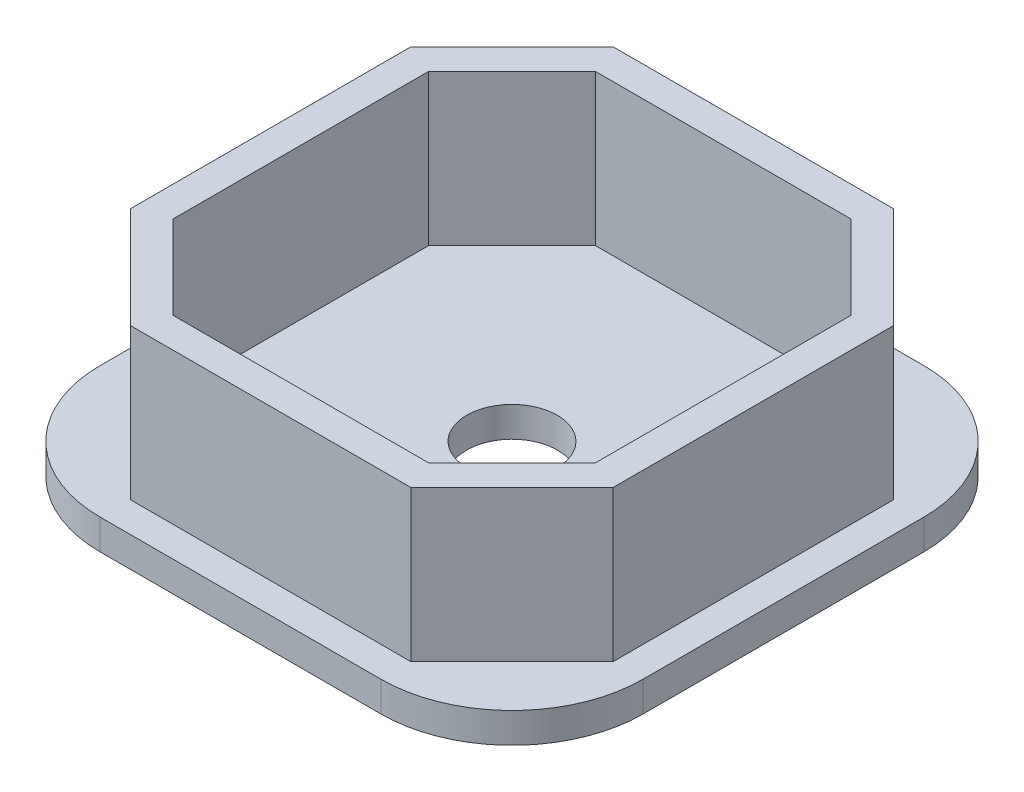
ISO-10303-21;
HEADER;
FILE_DESCRIPTION(('STEP AP214'),'2;1');
FILE_NAME('part.step','',(''),(''),'','','');
FILE_SCHEMA(('AUTOMOTIVE_DESIGN { 1 0 10303 214 1 1 1 1 }'));
ENDSEC;
DATA;
#1=APPLICATION_CONTEXT('core data for automotive mechanical design processes');
#2=APPLICATION_PROTOCOL_DEFINITION('international standard','automotive_design',2000,#1);
#3=PRODUCT_CONTEXT('',#1,'mechanical');
#4=PRODUCT('Part','Part','',(#3));
#5=PRODUCT_RELATED_PRODUCT_CATEGORY('part','',(#4));
#6=PRODUCT_DEFINITION_FORMATION('','',#4);
#7=PRODUCT_DEFINITION_CONTEXT('part definition',#1,'design');
#8=PRODUCT_DEFINITION('design','',#6,#7);
#9=PRODUCT_DEFINITION_SHAPE('','',#8);
#10=(LENGTH_UNIT() NAMED_UNIT(*) SI_UNIT(.MILLI.,.METRE.));
#11=(NAMED_UNIT(*) PLANE_ANGLE_UNIT() SI_UNIT($,.RADIAN.));
#12=(NAMED_UNIT(*) SI_UNIT($,.STERADIAN.) SOLID_ANGLE_UNIT());
#13=UNCERTAINTY_MEASURE_WITH_UNIT(LENGTH_MEASURE(1.E-05),#10,'distance_accuracy_value','');
#14=(GEOMETRIC_REPRESENTATION_CONTEXT(3) GLOBAL_UNCERTAINTY_ASSIGNED_CONTEXT((#13)) GLOBAL_UNIT_ASSIGNED_CONTEXT((#10,
#11,#12)) REPRESENTATION_CONTEXT('',''));
#15=CARTESIAN_POINT('',(0.,0.,0.));
#16=DIRECTION('',(0.,0.,1.));
#17=DIRECTION('',(1.,0.,0.));
#18=AXIS2_PLACEMENT_3D('',#15,#16,#17);
#19=CARTESIAN_POINT('',(-4.65,1.,4.65));
#20=DIRECTION('',(0.,-1.,0.));
#21=DIRECTION('',(0.,0.,-1.));
#22=AXIS2_PLACEMENT_3D('',#19,#20,#21);
#23=PLANE('',#22);
#24=CARTESIAN_POINT('',(-4.65,1.,4.65));
#25=DIRECTION('',(0.,1.,0.));
#26=DIRECTION('',(0.,0.,-1.));
#27=AXIS2_PLACEMENT_3D('',#24,#25,#26);
#28=CIRCLE('',#27,4.35);
#29=CARTESIAN_POINT('',(-9.,1.,4.64999999999997));
#30=VERTEX_POINT('',#29);
#31=CARTESIAN_POINT('',(-4.64999999999997,1.,9.));
#32=VERTEX_POINT('',#31);
#33=EDGE_CURVE('E330',#30,#32,#28,.T.);
#34=ORIENTED_EDGE('',*,*,#33,.T.);
#35=DIRECTION('',(1.,0.,0.));
#36=VECTOR('',#35,1.);
#37=CARTESIAN_POINT('',(-4.64999999999997,1.,9.));
#38=LINE('',#37,#36);
#39=CARTESIAN_POINT('',(4.64999999999997,1.,9.));
#40=VERTEX_POINT('',#39);
#41=EDGE_CURVE('E333',#32,#40,#38,.T.);
#42=ORIENTED_EDGE('',*,*,#41,.T.);
#43=CARTESIAN_POINT('',(4.65,1.,4.65));
#44=DIRECTION('',(0.,1.,0.));
#45=DIRECTION('',(0.,0.,-1.));
#46=AXIS2_PLACEMENT_3D('',#43,#44,#45);
#47=CIRCLE('',#46,4.35);
#48=CARTESIAN_POINT('',(9.,1.,4.64999999999997));
#49=VERTEX_POINT('',#48);
#50=EDGE_CURVE('E336',#40,#49,#47,.T.);
#51=ORIENTED_EDGE('',*,*,#50,.T.);
#52=DIRECTION('',(0.,0.,-1.));
#53=VECTOR('',#52,1.);
#54=CARTESIAN_POINT('',(9.,1.,4.64999999999997));
#55=LINE('',#54,#53);
#56=CARTESIAN_POINT('',(9.,1.,-4.64999999999997));
#57=VERTEX_POINT('',#56);
#58=EDGE_CURVE('E338',#49,#57,#55,.T.);
#59=ORIENTED_EDGE('',*,*,#58,.T.);
#60=CARTESIAN_POINT('',(4.65,1.,-4.65));
#61=DIRECTION('',(0.,1.,0.));
#62=DIRECTION('',(0.,0.,-1.));
#63=AXIS2_PLACEMENT_3D('',#60,#61,#62);
#64=CIRCLE('',#63,4.35);
#65=CARTESIAN_POINT('',(4.64999999999997,1.,-9.));
#66=VERTEX_POINT('',#65);
#67=EDGE_CURVE('E340',#57,#66,#64,.T.);
#68=ORIENTED_EDGE('',*,*,#67,.T.);
#69=DIRECTION('',(-1.,0.,0.));
#70=VECTOR('',#69,1.);
#71=CARTESIAN_POINT('',(-4.64999999999997,1.,-9.));
#72=LINE('',#71,#70);
#73=CARTESIAN_POINT('',(-4.64999999999997,1.,-9.));
#74=VERTEX_POINT('',#73);
#75=EDGE_CURVE('E342',#66,#74,#72,.T.);
#76=ORIENTED_EDGE('',*,*,#75,.T.);
#77=CARTESIAN_POINT('',(-4.65,1.,-4.65));
#78=DIRECTION('',(0.,1.,0.));
#79=DIRECTION('',(0.,0.,-1.));
#80=AXIS2_PLACEMENT_3D('',#77,#78,#79);
#81=CIRCLE('',#80,4.35);
#82=CARTESIAN_POINT('',(-9.,1.,-4.64999999999997));
#83=VERTEX_POINT('',#82);
#84=EDGE_CURVE('E344',#74,#83,#81,.T.);
#85=ORIENTED_EDGE('',*,*,#84,.T.);
#86=DIRECTION('',(0.,0.,1.));
#87=VECTOR('',#86,1.);
#88=CARTESIAN_POINT('',(-9.,1.,4.64999999999997));
#89=LINE('',#88,#87);
#90=EDGE_CURVE('E346',#83,#30,#89,.T.);
#91=ORIENTED_EDGE('',*,*,#90,.T.);
#92=EDGE_LOOP('',(#34,#42,#51,#59,#68,#76,#85,#91));
#93=FACE_BOUND('',#92,.T.);
#94=DIRECTION('',(0.,0.,1.));
#95=VECTOR('',#94,1.);
#96=CARTESIAN_POINT('',(-8.,1.,4.64999999999998));
#97=LINE('',#96,#95);
#98=CARTESIAN_POINT('',(-8.,1.,-4.64999999999998));
#99=VERTEX_POINT('',#98);
#100=CARTESIAN_POINT('',(-8.,1.,4.64999999999998));
#101=VERTEX_POINT('',#100);
#102=EDGE_CURVE('E211',#99,#101,#97,.T.);
#103=ORIENTED_EDGE('',*,*,#102,.F.);
#104=DIRECTION('',(-0.707106781186547,0.,0.707106781186547));
#105=VECTOR('',#104,1.);
#106=CARTESIAN_POINT('',(-8.,1.,-4.64999999999998));
#107=LINE('',#106,#105);
#108=CARTESIAN_POINT('',(-4.64999999999998,1.,-8.));
#109=VERTEX_POINT('',#108);
#110=EDGE_CURVE('E268',#109,#99,#107,.T.);
#111=ORIENTED_EDGE('',*,*,#110,.F.);
#112=DIRECTION('',(-1.,0.,0.));
#113=VECTOR('',#112,1.);
#114=CARTESIAN_POINT('',(-4.64999999999998,1.,-8.));
#115=LINE('',#114,#113);
#116=CARTESIAN_POINT('',(4.64999999999998,1.,-8.));
#117=VERTEX_POINT('',#116);
#118=EDGE_CURVE('E296',#117,#109,#115,.T.);
#119=ORIENTED_EDGE('',*,*,#118,.F.);
#120=DIRECTION('',(-0.707106781186547,0.,-0.707106781186547));
#121=VECTOR('',#120,1.);
#122=CARTESIAN_POINT('',(4.64999999999998,1.,-8.));
#123=LINE('',#122,#121);
#124=CARTESIAN_POINT('',(8.,1.,-4.64999999999998));
#125=VERTEX_POINT('',#124);
#126=EDGE_CURVE('E293',#125,#117,#123,.T.);
#127=ORIENTED_EDGE('',*,*,#126,.F.);
#128=DIRECTION('',(0.,0.,-1.));
#129=VECTOR('',#128,1.);
#130=CARTESIAN_POINT('',(8.,1.,4.64999999999998));
#131=LINE('',#130,#129);
#132=CARTESIAN_POINT('',(8.,1.,4.64999999999998));
#133=VERTEX_POINT('',#132);
#134=EDGE_CURVE('E290',#133,#125,#131,.T.);
#135=ORIENTED_EDGE('',*,*,#134,.F.);
#136=DIRECTION('',(0.707106781186547,0.,-0.707106781186547));
#137=VECTOR('',#136,1.);
#138=CARTESIAN_POINT('',(4.64999999999998,1.,8.));
#139=LINE('',#138,#137);
#140=CARTESIAN_POINT('',(4.64999999999998,1.,8.));
#141=VERTEX_POINT('',#140);
#142=EDGE_CURVE('E287',#141,#133,#139,.T.);
#143=ORIENTED_EDGE('',*,*,#142,.F.);
#144=DIRECTION('',(1.,0.,0.));
#145=VECTOR('',#144,1.);
#146=CARTESIAN_POINT('',(-4.64999999999998,1.,8.));
#147=LINE('',#146,#145);
#148=CARTESIAN_POINT('',(-4.64999999999998,1.,8.));
#149=VERTEX_POINT('',#148);
#150=EDGE_CURVE('E53',#149,#141,#147,.T.);
#151=ORIENTED_EDGE('',*,*,#150,.F.);
#152=DIRECTION('',(0.707106781186547,0.,0.707106781186547));
#153=VECTOR('',#152,1.);
#154=CARTESIAN_POINT('',(-4.64999999999998,1.,8.));
#155=LINE('',#154,#153);
#156=EDGE_CURVE('E48',#101,#149,#155,.T.);
#157=ORIENTED_EDGE('',*,*,#156,.F.);
#158=EDGE_LOOP('',(#103,#111,#119,#127,#135,#143,#151,#157));
#159=FACE_BOUND('',#158,.T.);
#160=ADVANCED_FACE('F33',(#93,#159),#23,.F.);
#161=DIRECTION('',(-0.707106781186548,0.,0.707106781186548));
#162=VECTOR('',#161,1.);
#163=CARTESIAN_POINT('',(-7.,1.,-4.23578643762688));
#164=LINE('',#163,#162);
#165=CARTESIAN_POINT('',(-4.23578643762688,1.,-7.));
#166=VERTEX_POINT('',#165);
#167=CARTESIAN_POINT('',(-7.,1.,-4.23578643762688));
#168=VERTEX_POINT('',#167);
#169=EDGE_CURVE('E204',#166,#168,#164,.T.);
#170=ORIENTED_EDGE('',*,*,#169,.T.);
#171=DIRECTION('',(0.,0.,1.));
#172=VECTOR('',#171,1.);
#173=CARTESIAN_POINT('',(-7.,1.,4.23578643762688));
#174=LINE('',#173,#172);
#175=CARTESIAN_POINT('',(-7.,1.,4.23578643762688));
#176=VERTEX_POINT('',#175);
#177=EDGE_CURVE('E232',#168,#176,#174,.T.);
#178=ORIENTED_EDGE('',*,*,#177,.T.);
#179=DIRECTION('',(0.707106781186548,0.,0.707106781186548));
#180=VECTOR('',#179,1.);
#181=CARTESIAN_POINT('',(-4.23578643762688,1.,7.));
#182=LINE('',#181,#180);
#183=CARTESIAN_POINT('',(-4.23578643762688,1.,7.));
#184=VERTEX_POINT('',#183);
#185=EDGE_CURVE('E210',#176,#184,#182,.T.);
#186=ORIENTED_EDGE('',*,*,#185,.T.);
#187=DIRECTION('',(1.,0.,0.));
#188=VECTOR('',#187,1.);
#189=CARTESIAN_POINT('',(-4.23578643762688,1.,7.));
#190=LINE('',#189,#188);
#191=CARTESIAN_POINT('',(4.23578643762688,1.,7.));
#192=VERTEX_POINT('',#191);
#193=EDGE_CURVE('E235',#184,#192,#190,.T.);
#194=ORIENTED_EDGE('',*,*,#193,.T.);
#195=DIRECTION('',(0.707106781186548,0.,-0.707106781186547));
#196=VECTOR('',#195,1.);
#197=CARTESIAN_POINT('',(4.23578643762688,1.,7.));
#198=LINE('',#197,#196);
#199=CARTESIAN_POINT('',(7.,1.,4.23578643762688));
#200=VERTEX_POINT('',#199);
#201=EDGE_CURVE('E238',#192,#200,#198,.T.);
#202=ORIENTED_EDGE('',*,*,#201,.T.);
#203=DIRECTION('',(0.,0.,-1.));
#204=VECTOR('',#203,1.);
#205=CARTESIAN_POINT('',(7.,1.,4.23578643762688));
#206=LINE('',#205,#204);
#207=CARTESIAN_POINT('',(7.,1.,-4.23578643762688));
#208=VERTEX_POINT('',#207);
#209=EDGE_CURVE('E241',#200,#208,#206,.T.);
#210=ORIENTED_EDGE('',*,*,#209,.T.);
#211=DIRECTION('',(-0.707106781186547,0.,-0.707106781186548));
#212=VECTOR('',#211,1.);
#213=CARTESIAN_POINT('',(4.23578643762688,1.,-7.));
#214=LINE('',#213,#212);
#215=CARTESIAN_POINT('',(4.23578643762688,1.,-7.));
#216=VERTEX_POINT('',#215);
#217=EDGE_CURVE('E244',#208,#216,#214,.T.);
#218=ORIENTED_EDGE('',*,*,#217,.T.);
#219=DIRECTION('',(-1.,0.,0.));
#220=VECTOR('',#219,1.);
#221=CARTESIAN_POINT('',(-4.23578643762688,1.,-7.));
#222=LINE('',#221,#220);
#223=EDGE_CURVE('E247',#216,#166,#222,.T.);
#224=ORIENTED_EDGE('',*,*,#223,.T.);
#225=EDGE_LOOP('',(#170,#178,#186,#194,#202,#210,#218,#224));
#226=FACE_BOUND('',#225,.T.);
#227=CARTESIAN_POINT('',(0.,1.,0.));
#228=DIRECTION('',(0.,1.,0.));
#229=DIRECTION('',(0.,0.,1.));
#230=AXIS2_PLACEMENT_3D('',#227,#228,#229);
#231=CIRCLE('',#230,1.5);
#232=CARTESIAN_POINT('',(0.,1.,1.5));
#233=VERTEX_POINT('',#232);
#234=EDGE_CURVE('E324',#233,#233,#231,.T.);
#235=ORIENTED_EDGE('',*,*,#234,.F.);
#236=EDGE_LOOP('',(#235));
#237=FACE_BOUND('',#236,.T.);
#238=ADVANCED_FACE('F431',(#226,#237),#23,.F.);
#239=CARTESIAN_POINT('',(-4.65,0.,4.65));
#240=DIRECTION('',(0.,-1.,0.));
#241=DIRECTION('',(0.,0.,-1.));
#242=AXIS2_PLACEMENT_3D('',#239,#240,#241);
#243=PLANE('',#242);
#244=CARTESIAN_POINT('',(-4.65,0.,4.65));
#245=DIRECTION('',(0.,1.,0.));
#246=DIRECTION('',(0.,0.,-1.));
#247=AXIS2_PLACEMENT_3D('',#244,#245,#246);
#248=CIRCLE('',#247,4.35);
#249=CARTESIAN_POINT('',(-9.,0.,4.64999999999997));
#250=VERTEX_POINT('',#249);
#251=CARTESIAN_POINT('',(-4.64999999999997,0.,9.));
#252=VERTEX_POINT('',#251);
#253=EDGE_CURVE('E327',#250,#252,#248,.T.);
#254=ORIENTED_EDGE('',*,*,#253,.F.);
#255=DIRECTION('',(0.,0.,1.));
#256=VECTOR('',#255,1.);
#257=CARTESIAN_POINT('',(-9.,0.,4.64999999999997));
#258=LINE('',#257,#256);
#259=CARTESIAN_POINT('',(-9.,0.,-4.64999999999997));
#260=VERTEX_POINT('',#259);
#261=EDGE_CURVE('E334',#260,#250,#258,.T.);
#262=ORIENTED_EDGE('',*,*,#261,.F.);
#263=CARTESIAN_POINT('',(-4.65,0.,-4.65));
#264=DIRECTION('',(0.,1.,0.));
#265=DIRECTION('',(0.,0.,-1.));
#266=AXIS2_PLACEMENT_3D('',#263,#264,#265);
#267=CIRCLE('',#266,4.35);
#268=CARTESIAN_POINT('',(-4.64999999999997,0.,-9.));
#269=VERTEX_POINT('',#268);
#270=EDGE_CURVE('E361',#269,#260,#267,.T.);
#271=ORIENTED_EDGE('',*,*,#270,.F.);
#272=DIRECTION('',(-1.,0.,0.));
#273=VECTOR('',#272,1.);
#274=CARTESIAN_POINT('',(-4.64999999999997,0.,-9.));
#275=LINE('',#274,#273);
#276=CARTESIAN_POINT('',(4.64999999999997,0.,-9.));
#277=VERTEX_POINT('',#276);
#278=EDGE_CURVE('E359',#277,#269,#275,.T.);
#279=ORIENTED_EDGE('',*,*,#278,.F.);
#280=CARTESIAN_POINT('',(4.65,0.,-4.65));
#281=DIRECTION('',(0.,1.,0.));
#282=DIRECTION('',(0.,0.,-1.));
#283=AXIS2_PLACEMENT_3D('',#280,#281,#282);
#284=CIRCLE('',#283,4.35);
#285=CARTESIAN_POINT('',(9.,0.,-4.64999999999997));
#286=VERTEX_POINT('',#285);
#287=EDGE_CURVE('E357',#286,#277,#284,.T.);
#288=ORIENTED_EDGE('',*,*,#287,.F.);
#289=DIRECTION('',(0.,0.,-1.));
#290=VECTOR('',#289,1.);
#291=CARTESIAN_POINT('',(9.,0.,4.64999999999997));
#292=LINE('',#291,#290);
#293=CARTESIAN_POINT('',(9.,0.,4.64999999999997));
#294=VERTEX_POINT('',#293);
#295=EDGE_CURVE('E355',#294,#286,#292,.T.);
#296=ORIENTED_EDGE('',*,*,#295,.F.);
#297=CARTESIAN_POINT('',(4.65,0.,4.65));
#298=DIRECTION('',(0.,1.,0.));
#299=DIRECTION('',(0.,0.,-1.));
#300=AXIS2_PLACEMENT_3D('',#297,#298,#299);
#301=CIRCLE('',#300,4.35);
#302=CARTESIAN_POINT('',(4.64999999999997,0.,9.));
#303=VERTEX_POINT('',#302);
#304=EDGE_CURVE('E353',#303,#294,#301,.T.);
#305=ORIENTED_EDGE('',*,*,#304,.F.);
#306=DIRECTION('',(1.,0.,0.));
#307=VECTOR('',#306,1.);
#308=CARTESIAN_POINT('',(-4.64999999999997,0.,9.));
#309=LINE('',#308,#307);
#310=EDGE_CURVE('E351',#252,#303,#309,.T.);
#311=ORIENTED_EDGE('',*,*,#310,.F.);
#312=EDGE_LOOP('',(#254,#262,#271,#279,#288,#296,#305,#311));
#313=FACE_BOUND('',#312,.T.);
#314=CARTESIAN_POINT('',(0.,0.,0.));
#315=DIRECTION('',(0.,1.,0.));
#316=DIRECTION('',(0.,0.,1.));
#317=AXIS2_PLACEMENT_3D('',#314,#315,#316);
#318=CIRCLE('',#317,1.5);
#319=CARTESIAN_POINT('',(0.,0.,1.5));
#320=VERTEX_POINT('',#319);
#321=EDGE_CURVE('E323',#320,#320,#318,.T.);
#322=ORIENTED_EDGE('',*,*,#321,.T.);
#323=EDGE_LOOP('',(#322));
#324=FACE_BOUND('',#323,.T.);
#325=ADVANCED_FACE('F391',(#313,#324),#243,.T.);
#326=CARTESIAN_POINT('',(-4.65,1.,4.65));
#327=DIRECTION('',(0.,-1.,0.));
#328=DIRECTION('',(0.,0.,-1.));
#329=AXIS2_PLACEMENT_3D('',#326,#327,#328);
#330=CYLINDRICAL_SURFACE('',#329,4.35);
#331=ORIENTED_EDGE('',*,*,#253,.T.);
#332=DIRECTION('',(0.,-1.,0.));
#333=VECTOR('',#332,1.);
#334=CARTESIAN_POINT('',(-4.64999999999997,1.,9.));
#335=LINE('',#334,#333);
#336=EDGE_CURVE('E11',#32,#252,#335,.T.);
#337=ORIENTED_EDGE('',*,*,#336,.F.);
#338=ORIENTED_EDGE('',*,*,#33,.F.);
#339=DIRECTION('',(0.,-1.,0.));
#340=VECTOR('',#339,1.);
#341=CARTESIAN_POINT('',(-9.,1.,4.64999999999997));
#342=LINE('',#341,#340);
#343=EDGE_CURVE('E348',#30,#250,#342,.T.);
#344=ORIENTED_EDGE('',*,*,#343,.T.);
#345=EDGE_LOOP('',(#331,#337,#338,#344));
#346=FACE_BOUND('',#345,.T.);
#347=ADVANCED_FACE('F35',(#346),#330,.T.);
#348=CARTESIAN_POINT('',(-4.64999999999997,1.,9.));
#349=DIRECTION('',(0.,0.,-1.));
#350=DIRECTION('',(-1.,0.,0.));
#351=AXIS2_PLACEMENT_3D('',#348,#349,#350);
#352=PLANE('',#351);
#353=ORIENTED_EDGE('',*,*,#310,.T.);
#354=DIRECTION('',(0.,-1.,0.));
#355=VECTOR('',#354,1.);
#356=CARTESIAN_POINT('',(4.64999999999997,1.,9.));
#357=LINE('',#356,#355);
#358=EDGE_CURVE('E41',#40,#303,#357,.T.);
#359=ORIENTED_EDGE('',*,*,#358,.F.);
#360=ORIENTED_EDGE('',*,*,#41,.F.);
#361=ORIENTED_EDGE('',*,*,#336,.T.);
#362=EDGE_LOOP('',(#353,#359,#360,#361));
#363=FACE_BOUND('',#362,.T.);
#364=ADVANCED_FACE('F408',(#363),#352,.F.);
#365=CARTESIAN_POINT('',(4.65,1.,4.65));
#366=DIRECTION('',(0.,-1.,0.));
#367=DIRECTION('',(0.,0.,-1.));
#368=AXIS2_PLACEMENT_3D('',#365,#366,#367);
#369=CYLINDRICAL_SURFACE('',#368,4.35);
#370=ORIENTED_EDGE('',*,*,#304,.T.);
#371=DIRECTION('',(0.,-1.,0.));
#372=VECTOR('',#371,1.);
#373=CARTESIAN_POINT('',(9.,1.,4.64999999999997));
#374=LINE('',#373,#372);
#375=EDGE_CURVE('E378',#49,#294,#374,.T.);
#376=ORIENTED_EDGE('',*,*,#375,.F.);
#377=ORIENTED_EDGE('',*,*,#50,.F.);
#378=ORIENTED_EDGE('',*,*,#358,.T.);
#379=EDGE_LOOP('',(#370,#376,#377,#378));
#380=FACE_BOUND('',#379,.T.);
#381=ADVANCED_FACE('F385',(#380),#369,.T.);
#382=CARTESIAN_POINT('',(9.,1.,4.64999999999997));
#383=DIRECTION('',(-1.,0.,0.));
#384=DIRECTION('',(0.,0.,1.));
#385=AXIS2_PLACEMENT_3D('',#382,#383,#384);
#386=PLANE('',#385);
#387=ORIENTED_EDGE('',*,*,#295,.T.);
#388=DIRECTION('',(0.,-1.,0.));
#389=VECTOR('',#388,1.);
#390=CARTESIAN_POINT('',(9.,1.,-4.64999999999997));
#391=LINE('',#390,#389);
#392=EDGE_CURVE('E375',#57,#286,#391,.T.);
#393=ORIENTED_EDGE('',*,*,#392,.F.);
#394=ORIENTED_EDGE('',*,*,#58,.F.);
#395=ORIENTED_EDGE('',*,*,#375,.T.);
#396=EDGE_LOOP('',(#387,#393,#394,#395));
#397=FACE_BOUND('',#396,.T.);
#398=ADVANCED_FACE('F397',(#397),#386,.F.);
#399=CARTESIAN_POINT('',(4.65,1.,-4.65));
#400=DIRECTION('',(0.,-1.,0.));
#401=DIRECTION('',(0.,0.,-1.));
#402=AXIS2_PLACEMENT_3D('',#399,#400,#401);
#403=CYLINDRICAL_SURFACE('',#402,4.35);
#404=ORIENTED_EDGE('',*,*,#287,.T.);
#405=DIRECTION('',(0.,-1.,0.));
#406=VECTOR('',#405,1.);
#407=CARTESIAN_POINT('',(4.64999999999997,1.,-9.));
#408=LINE('',#407,#406);
#409=EDGE_CURVE('E372',#66,#277,#408,.T.);
#410=ORIENTED_EDGE('',*,*,#409,.F.);
#411=ORIENTED_EDGE('',*,*,#67,.F.);
#412=ORIENTED_EDGE('',*,*,#392,.T.);
#413=EDGE_LOOP('',(#404,#410,#411,#412));
#414=FACE_BOUND('',#413,.T.);
#415=ADVANCED_FACE('F401',(#414),#403,.T.);
#416=CARTESIAN_POINT('',(-4.64999999999997,1.,-9.));
#417=DIRECTION('',(0.,0.,1.));
#418=DIRECTION('',(1.,0.,0.));
#419=AXIS2_PLACEMENT_3D('',#416,#417,#418);
#420=PLANE('',#419);
#421=ORIENTED_EDGE('',*,*,#278,.T.);
#422=DIRECTION('',(0.,-1.,0.));
#423=VECTOR('',#422,1.);
#424=CARTESIAN_POINT('',(-4.64999999999997,1.,-9.));
#425=LINE('',#424,#423);
#426=EDGE_CURVE('E369',#74,#269,#425,.T.);
#427=ORIENTED_EDGE('',*,*,#426,.F.);
#428=ORIENTED_EDGE('',*,*,#75,.F.);
#429=ORIENTED_EDGE('',*,*,#409,.T.);
#430=EDGE_LOOP('',(#421,#427,#428,#429));
#431=FACE_BOUND('',#430,.T.);
#432=ADVANCED_FACE('F421',(#431),#420,.F.);
#433=CARTESIAN_POINT('',(-4.65,1.,-4.65));
#434=DIRECTION('',(0.,-1.,0.));
#435=DIRECTION('',(0.,0.,-1.));
#436=AXIS2_PLACEMENT_3D('',#433,#434,#435);
#437=CYLINDRICAL_SURFACE('',#436,4.35);
#438=ORIENTED_EDGE('',*,*,#270,.T.);
#439=DIRECTION('',(0.,-1.,0.));
#440=VECTOR('',#439,1.);
#441=CARTESIAN_POINT('',(-9.,1.,-4.64999999999997));
#442=LINE('',#441,#440);
#443=EDGE_CURVE('E366',#83,#260,#442,.T.);
#444=ORIENTED_EDGE('',*,*,#443,.F.);
#445=ORIENTED_EDGE('',*,*,#84,.F.);
#446=ORIENTED_EDGE('',*,*,#426,.T.);
#447=EDGE_LOOP('',(#438,#444,#445,#446));
#448=FACE_BOUND('',#447,.T.);
#449=ADVANCED_FACE('F419',(#448),#437,.T.);
#450=CARTESIAN_POINT('',(-9.,1.,4.64999999999997));
#451=DIRECTION('',(1.,0.,0.));
#452=DIRECTION('',(0.,0.,-1.));
#453=AXIS2_PLACEMENT_3D('',#450,#451,#452);
#454=PLANE('',#453);
#455=ORIENTED_EDGE('',*,*,#261,.T.);
#456=ORIENTED_EDGE('',*,*,#343,.F.);
#457=ORIENTED_EDGE('',*,*,#90,.F.);
#458=ORIENTED_EDGE('',*,*,#443,.T.);
#459=EDGE_LOOP('',(#455,#456,#457,#458));
#460=FACE_BOUND('',#459,.T.);
#461=ADVANCED_FACE('F414',(#460),#454,.F.);
#462=CARTESIAN_POINT('',(0.,1.,0.));
#463=DIRECTION('',(0.,-1.,0.));
#464=DIRECTION('',(0.,0.,-1.));
#465=AXIS2_PLACEMENT_3D('',#462,#463,#464);
#466=CYLINDRICAL_SURFACE('',#465,1.5);
#467=ORIENTED_EDGE('',*,*,#234,.T.);
#468=EDGE_LOOP('',(#467));
#469=FACE_BOUND('',#468,.T.);
#470=ORIENTED_EDGE('',*,*,#321,.F.);
#471=EDGE_LOOP('',(#470));
#472=FACE_BOUND('',#471,.T.);
#473=ADVANCED_FACE('F439',(#469,#472),#466,.F.);
#474=CARTESIAN_POINT('',(0.,6.,0.));
#475=DIRECTION('',(0.,-1.,0.));
#476=DIRECTION('',(0.,0.,-1.));
#477=AXIS2_PLACEMENT_3D('',#474,#475,#476);
#478=PLANE('',#477);
#479=DIRECTION('',(0.,0.,1.));
#480=VECTOR('',#479,1.);
#481=CARTESIAN_POINT('',(-8.,6.,4.64999999999998));
#482=LINE('',#481,#480);
#483=CARTESIAN_POINT('',(-8.,6.,-4.64999999999998));
#484=VERTEX_POINT('',#483);
#485=CARTESIAN_POINT('',(-8.,6.,4.64999999999998));
#486=VERTEX_POINT('',#485);
#487=EDGE_CURVE('E264',#484,#486,#482,.T.);
#488=ORIENTED_EDGE('',*,*,#487,.T.);
#489=DIRECTION('',(0.707106781186547,0.,0.707106781186547));
#490=VECTOR('',#489,1.);
#491=CARTESIAN_POINT('',(-4.64999999999998,6.,8.));
#492=LINE('',#491,#490);
#493=CARTESIAN_POINT('',(-4.64999999999998,6.,8.));
#494=VERTEX_POINT('',#493);
#495=EDGE_CURVE('E267',#486,#494,#492,.T.);
#496=ORIENTED_EDGE('',*,*,#495,.T.);
#497=DIRECTION('',(1.,0.,0.));
#498=VECTOR('',#497,1.);
#499=CARTESIAN_POINT('',(-4.64999999999998,6.,8.));
#500=LINE('',#499,#498);
#501=CARTESIAN_POINT('',(4.64999999999998,6.,8.));
#502=VERTEX_POINT('',#501);
#503=EDGE_CURVE('E270',#494,#502,#500,.T.);
#504=ORIENTED_EDGE('',*,*,#503,.T.);
#505=DIRECTION('',(0.707106781186547,0.,-0.707106781186547));
#506=VECTOR('',#505,1.);
#507=CARTESIAN_POINT('',(4.64999999999998,6.,8.));
#508=LINE('',#507,#506);
#509=CARTESIAN_POINT('',(8.,6.,4.64999999999998));
#510=VERTEX_POINT('',#509);
#511=EDGE_CURVE('E272',#502,#510,#508,.T.);
#512=ORIENTED_EDGE('',*,*,#511,.T.);
#513=DIRECTION('',(0.,0.,-1.));
#514=VECTOR('',#513,1.);
#515=CARTESIAN_POINT('',(8.,6.,4.64999999999998));
#516=LINE('',#515,#514);
#517=CARTESIAN_POINT('',(8.,6.,-4.64999999999998));
#518=VERTEX_POINT('',#517);
#519=EDGE_CURVE('E274',#510,#518,#516,.T.);
#520=ORIENTED_EDGE('',*,*,#519,.T.);
#521=DIRECTION('',(-0.707106781186547,0.,-0.707106781186547));
#522=VECTOR('',#521,1.);
#523=CARTESIAN_POINT('',(4.64999999999998,6.,-8.));
#524=LINE('',#523,#522);
#525=CARTESIAN_POINT('',(4.64999999999998,6.,-8.));
#526=VERTEX_POINT('',#525);
#527=EDGE_CURVE('E276',#518,#526,#524,.T.);
#528=ORIENTED_EDGE('',*,*,#527,.T.);
#529=DIRECTION('',(-1.,0.,0.));
#530=VECTOR('',#529,1.);
#531=CARTESIAN_POINT('',(-4.64999999999998,6.,-8.));
#532=LINE('',#531,#530);
#533=CARTESIAN_POINT('',(-4.64999999999998,6.,-8.));
#534=VERTEX_POINT('',#533);
#535=EDGE_CURVE('E278',#526,#534,#532,.T.);
#536=ORIENTED_EDGE('',*,*,#535,.T.);
#537=DIRECTION('',(-0.707106781186547,0.,0.707106781186547));
#538=VECTOR('',#537,1.);
#539=CARTESIAN_POINT('',(-8.,6.,-4.64999999999998));
#540=LINE('',#539,#538);
#541=EDGE_CURVE('E280',#534,#484,#540,.T.);
#542=ORIENTED_EDGE('',*,*,#541,.T.);
#543=EDGE_LOOP('',(#488,#496,#504,#512,#520,#528,#536,#542));
#544=FACE_BOUND('',#543,.T.);
#545=DIRECTION('',(0.,0.,1.));
#546=VECTOR('',#545,1.);
#547=CARTESIAN_POINT('',(-7.,6.,4.23578643762688));
#548=LINE('',#547,#546);
#549=CARTESIAN_POINT('',(-7.,6.,-4.23578643762688));
#550=VERTEX_POINT('',#549);
#551=CARTESIAN_POINT('',(-7.,6.,4.23578643762688));
#552=VERTEX_POINT('',#551);
#553=EDGE_CURVE('E193',#550,#552,#548,.T.);
#554=ORIENTED_EDGE('',*,*,#553,.F.);
#555=DIRECTION('',(-0.707106781186548,0.,0.707106781186548));
#556=VECTOR('',#555,1.);
#557=CARTESIAN_POINT('',(-7.,6.,-4.23578643762688));
#558=LINE('',#557,#556);
#559=CARTESIAN_POINT('',(-4.23578643762688,6.,-7.));
#560=VERTEX_POINT('',#559);
#561=EDGE_CURVE('E230',#560,#550,#558,.T.);
#562=ORIENTED_EDGE('',*,*,#561,.F.);
#563=DIRECTION('',(-1.,0.,0.));
#564=VECTOR('',#563,1.);
#565=CARTESIAN_POINT('',(-4.23578643762688,6.,-7.));
#566=LINE('',#565,#564);
#567=CARTESIAN_POINT('',(4.23578643762688,6.,-7.));
#568=VERTEX_POINT('',#567);
#569=EDGE_CURVE('E227',#568,#560,#566,.T.);
#570=ORIENTED_EDGE('',*,*,#569,.F.);
#571=DIRECTION('',(-0.707106781186547,0.,-0.707106781186548));
#572=VECTOR('',#571,1.);
#573=CARTESIAN_POINT('',(4.23578643762688,6.,-7.));
#574=LINE('',#573,#572);
#575=CARTESIAN_POINT('',(7.,6.,-4.23578643762688));
#576=VERTEX_POINT('',#575);
#577=EDGE_CURVE('E225',#576,#568,#574,.T.);
#578=ORIENTED_EDGE('',*,*,#577,.F.);
#579=DIRECTION('',(0.,0.,-1.));
#580=VECTOR('',#579,1.);
#581=CARTESIAN_POINT('',(7.,6.,4.23578643762688));
#582=LINE('',#581,#580);
#583=CARTESIAN_POINT('',(7.,6.,4.23578643762688));
#584=VERTEX_POINT('',#583);
#585=EDGE_CURVE('E223',#584,#576,#582,.T.);
#586=ORIENTED_EDGE('',*,*,#585,.F.);
#587=DIRECTION('',(0.707106781186548,0.,-0.707106781186547));
#588=VECTOR('',#587,1.);
#589=CARTESIAN_POINT('',(4.23578643762688,6.,7.));
#590=LINE('',#589,#588);
#591=CARTESIAN_POINT('',(4.23578643762688,6.,7.));
#592=VERTEX_POINT('',#591);
#593=EDGE_CURVE('E219',#592,#584,#590,.T.);
#594=ORIENTED_EDGE('',*,*,#593,.F.);
#595=DIRECTION('',(1.,0.,0.));
#596=VECTOR('',#595,1.);
#597=CARTESIAN_POINT('',(-4.23578643762688,6.,7.));
#598=LINE('',#597,#596);
#599=CARTESIAN_POINT('',(-4.23578643762688,6.,7.));
#600=VERTEX_POINT('',#599);
#601=EDGE_CURVE('E217',#600,#592,#598,.T.);
#602=ORIENTED_EDGE('',*,*,#601,.F.);
#603=DIRECTION('',(0.707106781186548,0.,0.707106781186548));
#604=VECTOR('',#603,1.);
#605=CARTESIAN_POINT('',(-4.23578643762688,6.,7.));
#606=LINE('',#605,#604);
#607=EDGE_CURVE('E203',#552,#600,#606,.T.);
#608=ORIENTED_EDGE('',*,*,#607,.F.);
#609=EDGE_LOOP('',(#554,#562,#570,#578,#586,#594,#602,#608));
#610=FACE_BOUND('',#609,.T.);
#611=ADVANCED_FACE('F215',(#544,#610),#478,.F.);
#612=CARTESIAN_POINT('',(-8.,6.,4.64999999999998));
#613=DIRECTION('',(1.,0.,0.));
#614=DIRECTION('',(0.,0.,-1.));
#615=AXIS2_PLACEMENT_3D('',#612,#613,#614);
#616=PLANE('',#615);
#617=ORIENTED_EDGE('',*,*,#102,.T.);
#618=DIRECTION('',(0.,-1.,0.));
#619=VECTOR('',#618,1.);
#620=CARTESIAN_POINT('',(-8.,6.,4.64999999999998));
#621=LINE('',#620,#619);
#622=EDGE_CURVE('E321',#486,#101,#621,.T.);
#623=ORIENTED_EDGE('',*,*,#622,.F.);
#624=ORIENTED_EDGE('',*,*,#487,.F.);
#625=DIRECTION('',(0.,-1.,0.));
#626=VECTOR('',#625,1.);
#627=CARTESIAN_POINT('',(-8.,6.,-4.64999999999998));
#628=LINE('',#627,#626);
#629=EDGE_CURVE('E282',#484,#99,#628,.T.);
#630=ORIENTED_EDGE('',*,*,#629,.T.);
#631=EDGE_LOOP('',(#617,#623,#624,#630));
#632=FACE_BOUND('',#631,.T.);
#633=ADVANCED_FACE('F451',(#632),#616,.F.);
#634=CARTESIAN_POINT('',(-4.64999999999998,6.,8.));
#635=DIRECTION('',(0.707106781186548,0.,-0.707106781186548));
#636=DIRECTION('',(-0.707106781186548,0.,-0.707106781186548));
#637=AXIS2_PLACEMENT_3D('',#634,#635,#636);
#638=PLANE('',#637);
#639=ORIENTED_EDGE('',*,*,#156,.T.);
#640=DIRECTION('',(0.,-1.,0.));
#641=VECTOR('',#640,1.);
#642=CARTESIAN_POINT('',(-4.64999999999998,6.,8.));
#643=LINE('',#642,#641);
#644=EDGE_CURVE('E318',#494,#149,#643,.T.);
#645=ORIENTED_EDGE('',*,*,#644,.F.);
#646=ORIENTED_EDGE('',*,*,#495,.F.);
#647=ORIENTED_EDGE('',*,*,#622,.T.);
#648=EDGE_LOOP('',(#639,#645,#646,#647));
#649=FACE_BOUND('',#648,.T.);
#650=ADVANCED_FACE('F461',(#649),#638,.F.);
#651=CARTESIAN_POINT('',(-4.64999999999998,6.,8.));
#652=DIRECTION('',(0.,0.,-1.));
#653=DIRECTION('',(-1.,0.,0.));
#654=AXIS2_PLACEMENT_3D('',#651,#652,#653);
#655=PLANE('',#654);
#656=ORIENTED_EDGE('',*,*,#150,.T.);
#657=DIRECTION('',(0.,-1.,0.));
#658=VECTOR('',#657,1.);
#659=CARTESIAN_POINT('',(4.64999999999998,6.,8.));
#660=LINE('',#659,#658);
#661=EDGE_CURVE('E315',#502,#141,#660,.T.);
#662=ORIENTED_EDGE('',*,*,#661,.F.);
#663=ORIENTED_EDGE('',*,*,#503,.F.);
#664=ORIENTED_EDGE('',*,*,#644,.T.);
#665=EDGE_LOOP('',(#656,#662,#663,#664));
#666=FACE_BOUND('',#665,.T.);
#667=ADVANCED_FACE('F485',(#666),#655,.F.);
#668=CARTESIAN_POINT('',(4.64999999999998,6.,8.));
#669=DIRECTION('',(-0.707106781186548,0.,-0.707106781186548));
#670=DIRECTION('',(-0.707106781186548,0.,0.707106781186548));
#671=AXIS2_PLACEMENT_3D('',#668,#669,#670);
#672=PLANE('',#671);
#673=ORIENTED_EDGE('',*,*,#142,.T.);
#674=DIRECTION('',(0.,-1.,0.));
#675=VECTOR('',#674,1.);
#676=CARTESIAN_POINT('',(8.,6.,4.64999999999998));
#677=LINE('',#676,#675);
#678=EDGE_CURVE('E312',#510,#133,#677,.T.);
#679=ORIENTED_EDGE('',*,*,#678,.F.);
#680=ORIENTED_EDGE('',*,*,#511,.F.);
#681=ORIENTED_EDGE('',*,*,#661,.T.);
#682=EDGE_LOOP('',(#673,#679,#680,#681));
#683=FACE_BOUND('',#682,.T.);
#684=ADVANCED_FACE('F481',(#683),#672,.F.);
#685=CARTESIAN_POINT('',(8.,6.,4.64999999999998));
#686=DIRECTION('',(-1.,0.,0.));
#687=DIRECTION('',(0.,0.,1.));
#688=AXIS2_PLACEMENT_3D('',#685,#686,#687);
#689=PLANE('',#688);
#690=ORIENTED_EDGE('',*,*,#134,.T.);
#691=DIRECTION('',(0.,-1.,0.));
#692=VECTOR('',#691,1.);
#693=CARTESIAN_POINT('',(8.,6.,-4.64999999999998));
#694=LINE('',#693,#692);
#695=EDGE_CURVE('E309',#518,#125,#694,.T.);
#696=ORIENTED_EDGE('',*,*,#695,.F.);
#697=ORIENTED_EDGE('',*,*,#519,.F.);
#698=ORIENTED_EDGE('',*,*,#678,.T.);
#699=EDGE_LOOP('',(#690,#696,#697,#698));
#700=FACE_BOUND('',#699,.T.);
#701=ADVANCED_FACE('F477',(#700),#689,.F.);
#702=CARTESIAN_POINT('',(4.64999999999998,6.,-8.));
#703=DIRECTION('',(-0.707106781186548,0.,0.707106781186548));
#704=DIRECTION('',(0.707106781186548,0.,0.707106781186548));
#705=AXIS2_PLACEMENT_3D('',#702,#703,#704);
#706=PLANE('',#705);
#707=ORIENTED_EDGE('',*,*,#126,.T.);
#708=DIRECTION('',(0.,-1.,0.));
#709=VECTOR('',#708,1.);
#710=CARTESIAN_POINT('',(4.64999999999998,6.,-8.));
#711=LINE('',#710,#709);
#712=EDGE_CURVE('E306',#526,#117,#711,.T.);
#713=ORIENTED_EDGE('',*,*,#712,.F.);
#714=ORIENTED_EDGE('',*,*,#527,.F.);
#715=ORIENTED_EDGE('',*,*,#695,.T.);
#716=EDGE_LOOP('',(#707,#713,#714,#715));
#717=FACE_BOUND('',#716,.T.);
#718=ADVANCED_FACE('F473',(#717),#706,.F.);
#719=CARTESIAN_POINT('',(-4.64999999999998,6.,-8.));
#720=DIRECTION('',(0.,0.,1.));
#721=DIRECTION('',(1.,0.,0.));
#722=AXIS2_PLACEMENT_3D('',#719,#720,#721);
#723=PLANE('',#722);
#724=ORIENTED_EDGE('',*,*,#118,.T.);
#725=DIRECTION('',(0.,-1.,0.));
#726=VECTOR('',#725,1.);
#727=CARTESIAN_POINT('',(-4.64999999999998,6.,-8.));
#728=LINE('',#727,#726);
#729=EDGE_CURVE('E303',#534,#109,#728,.T.);
#730=ORIENTED_EDGE('',*,*,#729,.F.);
#731=ORIENTED_EDGE('',*,*,#535,.F.);
#732=ORIENTED_EDGE('',*,*,#712,.T.);
#733=EDGE_LOOP('',(#724,#730,#731,#732));
#734=FACE_BOUND('',#733,.T.);
#735=ADVANCED_FACE('F469',(#734),#723,.F.);
#736=CARTESIAN_POINT('',(-8.,6.,-4.64999999999998));
#737=DIRECTION('',(0.707106781186548,0.,0.707106781186548));
#738=DIRECTION('',(0.707106781186548,0.,-0.707106781186548));
#739=AXIS2_PLACEMENT_3D('',#736,#737,#738);
#740=PLANE('',#739);
#741=ORIENTED_EDGE('',*,*,#110,.T.);
#742=ORIENTED_EDGE('',*,*,#629,.F.);
#743=ORIENTED_EDGE('',*,*,#541,.F.);
#744=ORIENTED_EDGE('',*,*,#729,.T.);
#745=EDGE_LOOP('',(#741,#742,#743,#744));
#746=FACE_BOUND('',#745,.T.);
#747=ADVANCED_FACE('F466',(#746),#740,.F.);
#748=CARTESIAN_POINT('',(-7.,6.,4.23578643762688));
#749=DIRECTION('',(1.,0.,0.));
#750=DIRECTION('',(0.,0.,-1.));
#751=AXIS2_PLACEMENT_3D('',#748,#749,#750);
#752=PLANE('',#751);
#753=ORIENTED_EDGE('',*,*,#177,.F.);
#754=DIRECTION('',(0.,-1.,0.));
#755=VECTOR('',#754,1.);
#756=CARTESIAN_POINT('',(-7.,6.,-4.23578643762688));
#757=LINE('',#756,#755);
#758=EDGE_CURVE('E199',#550,#168,#757,.T.);
#759=ORIENTED_EDGE('',*,*,#758,.F.);
#760=ORIENTED_EDGE('',*,*,#553,.T.);
#761=DIRECTION('',(0.,-1.,0.));
#762=VECTOR('',#761,1.);
#763=CARTESIAN_POINT('',(-7.,6.,4.23578643762688));
#764=LINE('',#763,#762);
#765=EDGE_CURVE('E197',#552,#176,#764,.T.);
#766=ORIENTED_EDGE('',*,*,#765,.T.);
#767=EDGE_LOOP('',(#753,#759,#760,#766));
#768=FACE_BOUND('',#767,.T.);
#769=ADVANCED_FACE('F196',(#768),#752,.T.);
#770=CARTESIAN_POINT('',(-4.23578643762688,6.,7.));
#771=DIRECTION('',(0.707106781186548,0.,-0.707106781186548));
#772=DIRECTION('',(-0.707106781186548,0.,-0.707106781186548));
#773=AXIS2_PLACEMENT_3D('',#770,#771,#772);
#774=PLANE('',#773);
#775=ORIENTED_EDGE('',*,*,#185,.F.);
#776=ORIENTED_EDGE('',*,*,#765,.F.);
#777=ORIENTED_EDGE('',*,*,#607,.T.);
#778=DIRECTION('',(0.,-1.,0.));
#779=VECTOR('',#778,1.);
#780=CARTESIAN_POINT('',(-4.23578643762688,6.,7.));
#781=LINE('',#780,#779);
#782=EDGE_CURVE('E212',#600,#184,#781,.T.);
#783=ORIENTED_EDGE('',*,*,#782,.T.);
#784=EDGE_LOOP('',(#775,#776,#777,#783));
#785=FACE_BOUND('',#784,.T.);
#786=ADVANCED_FACE('F207',(#785),#774,.T.);
#787=CARTESIAN_POINT('',(-4.23578643762688,6.,7.));
#788=DIRECTION('',(0.,0.,-1.));
#789=DIRECTION('',(-1.,0.,0.));
#790=AXIS2_PLACEMENT_3D('',#787,#788,#789);
#791=PLANE('',#790);
#792=ORIENTED_EDGE('',*,*,#193,.F.);
#793=ORIENTED_EDGE('',*,*,#782,.F.);
#794=ORIENTED_EDGE('',*,*,#601,.T.);
#795=DIRECTION('',(0.,-1.,0.));
#796=VECTOR('',#795,1.);
#797=CARTESIAN_POINT('',(4.23578643762688,6.,7.));
#798=LINE('',#797,#796);
#799=EDGE_CURVE('E261',#592,#192,#798,.T.);
#800=ORIENTED_EDGE('',*,*,#799,.T.);
#801=EDGE_LOOP('',(#792,#793,#794,#800));
#802=FACE_BOUND('',#801,.T.);
#803=ADVANCED_FACE('F546',(#802),#791,.T.);
#804=CARTESIAN_POINT('',(4.23578643762688,6.,7.));
#805=DIRECTION('',(-0.707106781186547,0.,-0.707106781186548));
#806=DIRECTION('',(-0.707106781186548,0.,0.707106781186547));
#807=AXIS2_PLACEMENT_3D('',#804,#805,#806);
#808=PLANE('',#807);
#809=ORIENTED_EDGE('',*,*,#201,.F.);
#810=ORIENTED_EDGE('',*,*,#799,.F.);
#811=ORIENTED_EDGE('',*,*,#593,.T.);
#812=DIRECTION('',(0.,-1.,0.));
#813=VECTOR('',#812,1.);
#814=CARTESIAN_POINT('',(7.,6.,4.23578643762688));
#815=LINE('',#814,#813);
#816=EDGE_CURVE('E259',#584,#200,#815,.T.);
#817=ORIENTED_EDGE('',*,*,#816,.T.);
#818=EDGE_LOOP('',(#809,#810,#811,#817));
#819=FACE_BOUND('',#818,.T.);
#820=ADVANCED_FACE('F552',(#819),#808,.T.);
#821=CARTESIAN_POINT('',(7.,6.,4.23578643762688));
#822=DIRECTION('',(-1.,0.,0.));
#823=DIRECTION('',(0.,0.,1.));
#824=AXIS2_PLACEMENT_3D('',#821,#822,#823);
#825=PLANE('',#824);
#826=ORIENTED_EDGE('',*,*,#209,.F.);
#827=ORIENTED_EDGE('',*,*,#816,.F.);
#828=ORIENTED_EDGE('',*,*,#585,.T.);
#829=DIRECTION('',(0.,-1.,0.));
#830=VECTOR('',#829,1.);
#831=CARTESIAN_POINT('',(7.,6.,-4.23578643762688));
#832=LINE('',#831,#830);
#833=EDGE_CURVE('E257',#576,#208,#832,.T.);
#834=ORIENTED_EDGE('',*,*,#833,.T.);
#835=EDGE_LOOP('',(#826,#827,#828,#834));
#836=FACE_BOUND('',#835,.T.);
#837=ADVANCED_FACE('F560',(#836),#825,.T.);
#838=CARTESIAN_POINT('',(4.23578643762688,6.,-7.));
#839=DIRECTION('',(-0.707106781186548,0.,0.707106781186547));
#840=DIRECTION('',(0.707106781186547,0.,0.707106781186548));
#841=AXIS2_PLACEMENT_3D('',#838,#839,#840);
#842=PLANE('',#841);
#843=ORIENTED_EDGE('',*,*,#217,.F.);
#844=ORIENTED_EDGE('',*,*,#833,.F.);
#845=ORIENTED_EDGE('',*,*,#577,.T.);
#846=DIRECTION('',(0.,-1.,0.));
#847=VECTOR('',#846,1.);
#848=CARTESIAN_POINT('',(4.23578643762688,6.,-7.));
#849=LINE('',#848,#847);
#850=EDGE_CURVE('E255',#568,#216,#849,.T.);
#851=ORIENTED_EDGE('',*,*,#850,.T.);
#852=EDGE_LOOP('',(#843,#844,#845,#851));
#853=FACE_BOUND('',#852,.T.);
#854=ADVANCED_FACE('F568',(#853),#842,.T.);
#855=CARTESIAN_POINT('',(-4.23578643762688,6.,-7.));
#856=DIRECTION('',(0.,0.,1.));
#857=DIRECTION('',(1.,0.,0.));
#858=AXIS2_PLACEMENT_3D('',#855,#856,#857);
#859=PLANE('',#858);
#860=ORIENTED_EDGE('',*,*,#223,.F.);
#861=ORIENTED_EDGE('',*,*,#850,.F.);
#862=ORIENTED_EDGE('',*,*,#569,.T.);
#863=DIRECTION('',(0.,-1.,0.));
#864=VECTOR('',#863,1.);
#865=CARTESIAN_POINT('',(-4.23578643762688,6.,-7.));
#866=LINE('',#865,#864);
#867=EDGE_CURVE('E253',#560,#166,#866,.T.);
#868=ORIENTED_EDGE('',*,*,#867,.T.);
#869=EDGE_LOOP('',(#860,#861,#862,#868));
#870=FACE_BOUND('',#869,.T.);
#871=ADVANCED_FACE('F576',(#870),#859,.T.);
#872=CARTESIAN_POINT('',(-7.,6.,-4.23578643762688));
#873=DIRECTION('',(0.707106781186548,0.,0.707106781186548));
#874=DIRECTION('',(0.707106781186548,0.,-0.707106781186548));
#875=AXIS2_PLACEMENT_3D('',#872,#873,#874);
#876=PLANE('',#875);
#877=ORIENTED_EDGE('',*,*,#169,.F.);
#878=ORIENTED_EDGE('',*,*,#867,.F.);
#879=ORIENTED_EDGE('',*,*,#561,.T.);
#880=ORIENTED_EDGE('',*,*,#758,.T.);
#881=EDGE_LOOP('',(#877,#878,#879,#880));
#882=FACE_BOUND('',#881,.T.);
#883=ADVANCED_FACE('F584',(#882),#876,.T.);
#884=CLOSED_SHELL('',(#160,#238,#325,#347,#364,#381,#398,#415,#432,#449,#461,#473,#611,#633,
#650,#667,#684,#701,#718,#735,#747,#769,#786,#803,#820,#837,#854,#871,#883));
#885=MANIFOLD_SOLID_BREP('B2',#884);
#886=ADVANCED_BREP_SHAPE_REPRESENTATION('',(#18,#885),#14);
#887=SHAPE_DEFINITION_REPRESENTATION(#9,#886);
ENDSEC;
END-ISO-10303-21;
